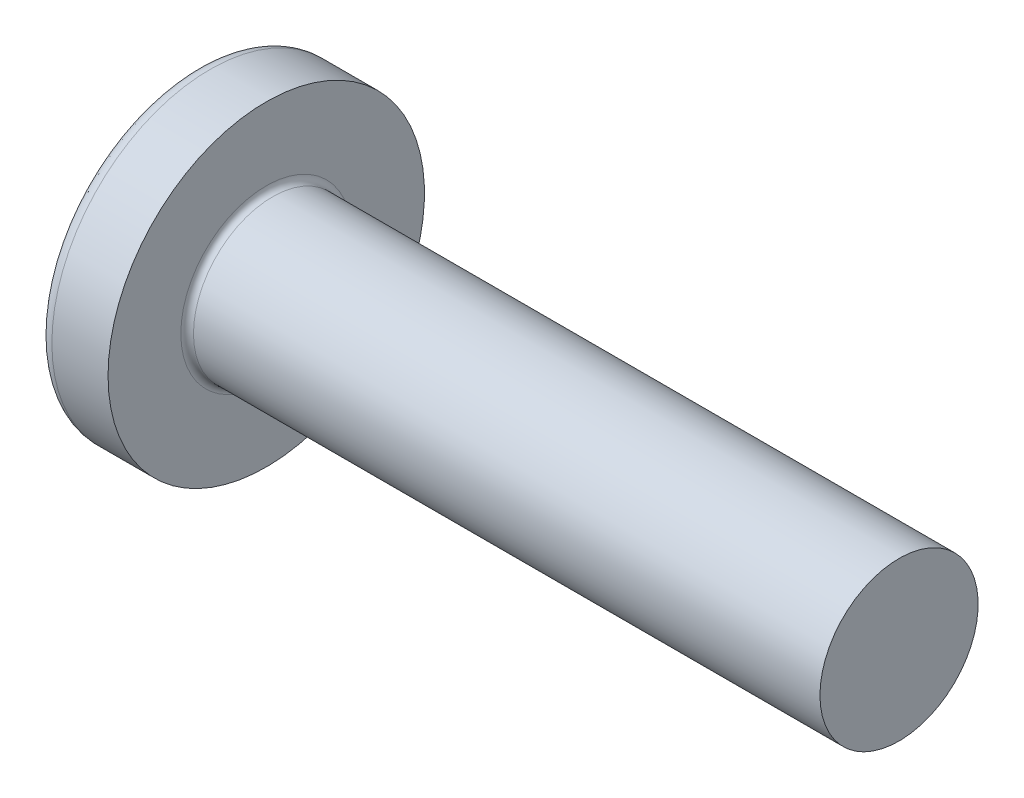
ISO-10303-21;
HEADER;
FILE_DESCRIPTION(('STEP AP214'),'2;1');
FILE_NAME('part.step','',(''),(''),'','','');
FILE_SCHEMA(('AUTOMOTIVE_DESIGN { 1 0 10303 214 1 1 1 1 }'));
ENDSEC;
DATA;
#1=APPLICATION_CONTEXT('core data for automotive mechanical design processes');
#2=APPLICATION_PROTOCOL_DEFINITION('international standard','automotive_design',2000,#1);
#3=PRODUCT_CONTEXT('',#1,'mechanical');
#4=PRODUCT('Part','Part','',(#3));
#5=PRODUCT_RELATED_PRODUCT_CATEGORY('part','',(#4));
#6=PRODUCT_DEFINITION_FORMATION('','',#4);
#7=PRODUCT_DEFINITION_CONTEXT('part definition',#1,'design');
#8=PRODUCT_DEFINITION('design','',#6,#7);
#9=PRODUCT_DEFINITION_SHAPE('','',#8);
#10=(LENGTH_UNIT() NAMED_UNIT(*) SI_UNIT(.MILLI.,.METRE.));
#11=(NAMED_UNIT(*) PLANE_ANGLE_UNIT() SI_UNIT($,.RADIAN.));
#12=(NAMED_UNIT(*) SI_UNIT($,.STERADIAN.) SOLID_ANGLE_UNIT());
#13=UNCERTAINTY_MEASURE_WITH_UNIT(LENGTH_MEASURE(1.E-05),#10,'distance_accuracy_value','');
#14=(GEOMETRIC_REPRESENTATION_CONTEXT(3) GLOBAL_UNCERTAINTY_ASSIGNED_CONTEXT((#13)) GLOBAL_UNIT_ASSIGNED_CONTEXT((#10,
#11,#12)) REPRESENTATION_CONTEXT('',''));
#15=CARTESIAN_POINT('',(0.,0.,0.));
#16=DIRECTION('',(0.,0.,1.));
#17=DIRECTION('',(1.,0.,0.));
#18=AXIS2_PLACEMENT_3D('',#15,#16,#17);
#19=CARTESIAN_POINT('',(16.,0.,0.));
#20=DIRECTION('',(-1.,0.,0.));
#21=DIRECTION('',(0.,1.,0.));
#22=AXIS2_PLACEMENT_3D('',#19,#20,#21);
#23=SPHERICAL_SURFACE('',#22,16.);
#24=CARTESIAN_POINT('',(3.23189799723057,0.,0.));
#25=DIRECTION('',(-1.,0.,0.));
#26=DIRECTION('',(0.,0.,1.));
#27=AXIS2_PLACEMENT_3D('',#24,#25,#26);
#28=CIRCLE('',#27,9.64238410596027);
#29=CARTESIAN_POINT('',(3.23189799723057,0.,9.64238410596027));
#30=VERTEX_POINT('',#29);
#31=EDGE_CURVE('E212',#30,#30,#28,.T.);
#32=ORIENTED_EDGE('',*,*,#31,.T.);
#33=EDGE_LOOP('',(#32));
#34=FACE_BOUND('',#33,.T.);
#35=CARTESIAN_POINT('',(0.168594787067849,0.,0.));
#36=DIRECTION('',(1.,0.,0.));
#37=DIRECTION('',(0.,0.,-1.));
#38=AXIS2_PLACEMENT_3D('',#35,#36,#37);
#39=CIRCLE('',#38,2.31659426398858);
#40=CARTESIAN_POINT('',(0.168594787067853,-1.07999999999999,-2.04944113941943));
#41=VERTEX_POINT('',#40);
#42=CARTESIAN_POINT('',(0.168594787067849,-2.04944113941942,-1.08));
#43=VERTEX_POINT('',#42);
#44=EDGE_CURVE('E338',#41,#43,#39,.F.);
#45=ORIENTED_EDGE('',*,*,#44,.F.);
#46=CARTESIAN_POINT('',(16.,-1.08,0.));
#47=DIRECTION('',(0.,1.,0.));
#48=DIRECTION('',(0.,0.,1.));
#49=AXIS2_PLACEMENT_3D('',#46,#47,#48);
#50=CIRCLE('',#49,15.9635083863166);
#51=CARTESIAN_POINT('',(0.712098414668225,-1.07999999999998,-4.59496083957308));
#52=VERTEX_POINT('',#51);
#53=EDGE_CURVE('E272',#52,#41,#50,.T.);
#54=ORIENTED_EDGE('',*,*,#53,.F.);
#55=CARTESIAN_POINT('',(14.7911432076015,0.,2.42459171093353));
#56=DIRECTION('',(0.446197800778958,0.,-0.89493436774996));
#57=DIRECTION('',(-0.89493436774996,0.,-0.446197800778958));
#58=AXIS2_PLACEMENT_3D('',#55,#56,#57);
#59=CIRCLE('',#58,15.7689574890271);
#60=CARTESIAN_POINT('',(0.712098414668225,1.08000000000002,-4.59496083957307));
#61=VERTEX_POINT('',#60);
#62=EDGE_CURVE('E246',#52,#61,#59,.T.);
#63=ORIENTED_EDGE('',*,*,#62,.T.);
#64=CARTESIAN_POINT('',(16.,1.08,0.));
#65=DIRECTION('',(0.,-1.,0.));
#66=DIRECTION('',(0.,0.,-1.));
#67=AXIS2_PLACEMENT_3D('',#64,#65,#66);
#68=CIRCLE('',#67,15.9635083863166);
#69=CARTESIAN_POINT('',(0.168594787067854,1.08000000000001,-2.04944113941942));
#70=VERTEX_POINT('',#69);
#71=EDGE_CURVE('E300',#70,#61,#68,.T.);
#72=ORIENTED_EDGE('',*,*,#71,.F.);
#73=CARTESIAN_POINT('',(0.168594787067849,2.04944113941941,-1.08));
#74=VERTEX_POINT('',#73);
#75=EDGE_CURVE('E353',#74,#70,#39,.F.);
#76=ORIENTED_EDGE('',*,*,#75,.F.);
#77=CARTESIAN_POINT('',(16.,0.,-1.08));
#78=DIRECTION('',(0.,0.,1.));
#79=DIRECTION('',(1.,0.,0.));
#80=AXIS2_PLACEMENT_3D('',#77,#78,#79);
#81=CIRCLE('',#80,15.9635083863166);
#82=CARTESIAN_POINT('',(0.712098414668223,4.59496083957308,-1.08));
#83=VERTEX_POINT('',#82);
#84=EDGE_CURVE('E240',#83,#74,#81,.T.);
#85=ORIENTED_EDGE('',*,*,#84,.F.);
#86=CARTESIAN_POINT('',(14.7911432076015,-2.42459171093353,0.));
#87=DIRECTION('',(0.446197800778958,0.89493436774996,0.));
#88=DIRECTION('',(-0.89493436774996,0.446197800778958,0.));
#89=AXIS2_PLACEMENT_3D('',#86,#87,#88);
#90=CIRCLE('',#89,15.7689574890271);
#91=CARTESIAN_POINT('',(0.712098414668223,4.59496083957308,1.08));
#92=VERTEX_POINT('',#91);
#93=EDGE_CURVE('E243',#83,#92,#90,.T.);
#94=ORIENTED_EDGE('',*,*,#93,.T.);
#95=CARTESIAN_POINT('',(16.,0.,1.08));
#96=DIRECTION('',(0.,0.,-1.));
#97=DIRECTION('',(0.,1.,0.));
#98=AXIS2_PLACEMENT_3D('',#95,#96,#97);
#99=CIRCLE('',#98,15.9635083863166);
#100=CARTESIAN_POINT('',(0.168594787067849,2.0494411394194,1.08));
#101=VERTEX_POINT('',#100);
#102=EDGE_CURVE('E236',#101,#92,#99,.T.);
#103=ORIENTED_EDGE('',*,*,#102,.F.);
#104=CARTESIAN_POINT('',(0.168594787067853,1.07999999999999,2.04944113941943));
#105=VERTEX_POINT('',#104);
#106=EDGE_CURVE('E352',#105,#101,#39,.F.);
#107=ORIENTED_EDGE('',*,*,#106,.F.);
#108=CARTESIAN_POINT('',(0.712098414668223,1.07999999999998,4.59496083957308));
#109=VERTEX_POINT('',#108);
#110=EDGE_CURVE('E256',#109,#105,#68,.T.);
#111=ORIENTED_EDGE('',*,*,#110,.F.);
#112=CARTESIAN_POINT('',(14.7911432076015,0.,-2.42459171093353));
#113=DIRECTION('',(0.446197800778958,0.,0.89493436774996));
#114=DIRECTION('',(0.89493436774996,0.,-0.446197800778958));
#115=AXIS2_PLACEMENT_3D('',#112,#113,#114);
#116=CIRCLE('',#115,15.7689574890271);
#117=CARTESIAN_POINT('',(0.712098414668221,-1.08000000000001,4.59496083957308));
#118=VERTEX_POINT('',#117);
#119=EDGE_CURVE('E47',#109,#118,#116,.T.);
#120=ORIENTED_EDGE('',*,*,#119,.T.);
#121=CARTESIAN_POINT('',(0.168594787067854,-1.08000000000001,2.04944113941942));
#122=VERTEX_POINT('',#121);
#123=EDGE_CURVE('E253',#122,#118,#50,.T.);
#124=ORIENTED_EDGE('',*,*,#123,.F.);
#125=CARTESIAN_POINT('',(0.168594787067849,-2.04944113941941,1.08));
#126=VERTEX_POINT('',#125);
#127=EDGE_CURVE('E384',#126,#122,#39,.F.);
#128=ORIENTED_EDGE('',*,*,#127,.F.);
#129=CARTESIAN_POINT('',(0.712098414668223,-4.59496083957308,1.08));
#130=VERTEX_POINT('',#129);
#131=EDGE_CURVE('E237',#130,#126,#99,.T.);
#132=ORIENTED_EDGE('',*,*,#131,.F.);
#133=CARTESIAN_POINT('',(14.7911432076015,2.42459171093353,0.));
#134=DIRECTION('',(0.446197800778958,-0.89493436774996,0.));
#135=DIRECTION('',(0.89493436774996,0.446197800778958,0.));
#136=AXIS2_PLACEMENT_3D('',#133,#134,#135);
#137=CIRCLE('',#136,15.7689574890271);
#138=CARTESIAN_POINT('',(0.712098414668223,-4.59496083957308,-1.08));
#139=VERTEX_POINT('',#138);
#140=EDGE_CURVE('E233',#130,#139,#137,.T.);
#141=ORIENTED_EDGE('',*,*,#140,.T.);
#142=EDGE_CURVE('E62',#43,#139,#81,.T.);
#143=ORIENTED_EDGE('',*,*,#142,.F.);
#144=EDGE_LOOP('',(#45,#54,#63,#72,#76,#85,#94,#103,#107,#111,#120,#124,#128,#132,#141,#143));
#145=FACE_BOUND('',#144,.T.);
#146=ADVANCED_FACE('F34',(#34,#145),#23,.T.);
#147=CARTESIAN_POINT('',(0.,4.94999999999999,-1.08));
#148=DIRECTION('',(0.,0.,1.));
#149=DIRECTION('',(1.,0.,0.));
#150=AXIS2_PLACEMENT_3D('',#147,#148,#149);
#151=PLANE('',#150);
#152=ORIENTED_EDGE('',*,*,#84,.T.);
#153=CARTESIAN_POINT('',(-3.43605311056389,2.33057774319368,-1.08));
#154=CARTESIAN_POINT('',(-2.73005788936149,2.27615518507629,-1.08));
#155=CARTESIAN_POINT('',(-2.02408650858328,2.22141913982355,-1.08));
#156=CARTESIAN_POINT('',(-0.612196178896328,2.11110719124856,-1.08));
#157=CARTESIAN_POINT('',(0.0937227687909005,2.05553127230214,-1.08));
#158=CARTESIAN_POINT('',(1.15253879223642,1.97137932907642,-1.08));
#159=CARTESIAN_POINT('',(1.50546717443927,1.94319732850324,-1.08));
#160=CARTESIAN_POINT('',(2.21129884226403,1.88653195912772,-1.08));
#161=CARTESIAN_POINT('',(2.56420212794819,1.85804859110097,-1.08));
#162=CARTESIAN_POINT('',(3.26997437360886,1.80073759682966,-1.08));
#163=CARTESIAN_POINT('',(3.62284333408858,1.77190997678611,-1.08));
#164=CARTESIAN_POINT('',(4.32855163516413,1.71385567830055,-1.08));
#165=CARTESIAN_POINT('',(4.68139097546501,1.68462899627166,-1.08));
#166=CARTESIAN_POINT('',(5.48196138691584,1.61778484426536,-1.08));
#167=CARTESIAN_POINT('',(5.92968063936628,1.5800255789917,-1.08));
#168=CARTESIAN_POINT('',(6.82503914618352,1.50358396776163,-1.08));
#169=CARTESIAN_POINT('',(7.27267840078263,1.46490162453115,-1.08));
#170=CARTESIAN_POINT('',(8.16783657307055,1.38637288862663,-1.08));
#171=CARTESIAN_POINT('',(8.61535549493061,1.34652654360286,-1.08));
#172=CARTESIAN_POINT('',(9.51026248486919,1.26532289179753,-1.08));
#173=CARTESIAN_POINT('',(9.95765055123334,1.22396556604181,-1.08));
#174=CARTESIAN_POINT('',(10.8523158736642,1.13920912306466,-1.08));
#175=CARTESIAN_POINT('',(11.2995930947875,1.09580963592832,-1.08));
#176=CARTESIAN_POINT('',(12.1938496891445,1.00615798148881,-1.08));
#177=CARTESIAN_POINT('',(12.6408290721386,0.959905912835485,-1.08));
#178=CARTESIAN_POINT('',(13.3109832262361,0.887238538031377,-1.08));
#179=CARTESIAN_POINT('',(13.5343356366705,0.862465479305157,-1.08));
#180=CARTESIAN_POINT('',(13.9808744583761,0.811493247434636,-1.08));
#181=CARTESIAN_POINT('',(14.204060872408,0.785294098569612,-1.08));
#182=CARTESIAN_POINT('',(14.6502320441495,0.73099572543514,-1.08));
#183=CARTESIAN_POINT('',(14.8732167746121,0.702896274763054,-1.08));
#184=CARTESIAN_POINT('',(15.2074339176581,0.658726299947166,-1.08));
#185=CARTESIAN_POINT('',(15.3187994773757,0.643665717094798,-1.08));
#186=CARTESIAN_POINT('',(15.5414149899271,0.612700054932443,-1.08));
#187=CARTESIAN_POINT('',(15.6526649406011,0.596794960123566,-1.08));
#188=CARTESIAN_POINT('',(15.7638416271016,0.580382331183072,-1.08));
#189=B_SPLINE_CURVE_WITH_KNOTS('',3,(#153,#154,#155,#156,#157,#158,#159,#160,#161,#162,#163,
#164,#165,#166,#167,#168,#169,#170,#171,#172,#173,#174,#175,#176,#177,#178,#179,#180,#181,#182,
#183,#184,#185,#186,#187,#188),.UNSPECIFIED.,.F.,.F.,(4,2,2,2,2,2,2,2,2,2,2,2,2,2,2,2,2,4),(0.,
2.12426964290659,4.24857885235091,5.3107341035929,6.37288662197896,7.43502003656715,
8.49716300414631,9.84508827634153,11.1930095684778,12.5408757584157,13.8887588800163,
15.2368871027213,16.5849687296847,17.2591314568035,17.9332827098455,18.6075144234906,
18.9446495011757,19.2817907682658),.UNSPECIFIED.);
#190=CARTESIAN_POINT('',(5.69,1.60013444747621,-1.08));
#191=VERTEX_POINT('',#190);
#192=EDGE_CURVE('E373',#74,#191,#189,.T.);
#193=ORIENTED_EDGE('',*,*,#192,.T.);
#194=DIRECTION('',(0.,1.,0.));
#195=VECTOR('',#194,1.);
#196=CARTESIAN_POINT('',(5.69,-2.11307074806449,-1.08));
#197=LINE('',#196,#195);
#198=CARTESIAN_POINT('',(5.69,2.11307074806449,-1.08));
#199=VERTEX_POINT('',#198);
#200=EDGE_CURVE('E321',#191,#199,#197,.T.);
#201=ORIENTED_EDGE('',*,*,#200,.T.);
#202=DIRECTION('',(0.89493436774996,-0.446197800778958,0.));
#203=VECTOR('',#202,1.);
#204=CARTESIAN_POINT('',(0.,4.95,-1.08));
#205=LINE('',#204,#203);
#206=EDGE_CURVE('E213',#83,#199,#205,.T.);
#207=ORIENTED_EDGE('',*,*,#206,.F.);
#208=EDGE_LOOP('',(#152,#193,#201,#207));
#209=FACE_BOUND('',#208,.T.);
#210=ADVANCED_FACE('F168',(#209),#151,.T.);
#211=CARTESIAN_POINT('',(5.69,-2.11307074806449,-1.08));
#212=VERTEX_POINT('',#211);
#213=CARTESIAN_POINT('',(5.69,-1.60013444747621,-1.08));
#214=VERTEX_POINT('',#213);
#215=EDGE_CURVE('E221',#212,#214,#197,.T.);
#216=ORIENTED_EDGE('',*,*,#215,.T.);
#217=CARTESIAN_POINT('',(-3.43605311056389,-2.33057774319368,-1.08));
#218=CARTESIAN_POINT('',(-2.73005788936149,-2.27615518507629,-1.08));
#219=CARTESIAN_POINT('',(-2.02408650858328,-2.22141913982355,-1.08));
#220=CARTESIAN_POINT('',(-0.612196178896328,-2.11110719124856,-1.08));
#221=CARTESIAN_POINT('',(0.0937227687909004,-2.05553127230214,-1.08));
#222=CARTESIAN_POINT('',(1.15253879223642,-1.97137932907642,-1.08));
#223=CARTESIAN_POINT('',(1.50546717443927,-1.94319732850324,-1.08));
#224=CARTESIAN_POINT('',(2.21129884226403,-1.88653195912772,-1.08));
#225=CARTESIAN_POINT('',(2.56420212794819,-1.85804859110097,-1.08));
#226=CARTESIAN_POINT('',(3.26997437360886,-1.80073759682966,-1.08));
#227=CARTESIAN_POINT('',(3.62284333408858,-1.77190997678611,-1.08));
#228=CARTESIAN_POINT('',(4.32855163516414,-1.71385567830055,-1.08));
#229=CARTESIAN_POINT('',(4.68139097546501,-1.68462899627166,-1.08));
#230=CARTESIAN_POINT('',(5.48196138691584,-1.61778484426536,-1.08));
#231=CARTESIAN_POINT('',(5.92968063936628,-1.5800255789917,-1.08));
#232=CARTESIAN_POINT('',(6.82503914618352,-1.50358396776163,-1.08));
#233=CARTESIAN_POINT('',(7.27267840078262,-1.46490162453115,-1.08));
#234=CARTESIAN_POINT('',(8.16783657307055,-1.38637288862663,-1.08));
#235=CARTESIAN_POINT('',(8.6153554949306,-1.34652654360286,-1.08));
#236=CARTESIAN_POINT('',(9.51026248486919,-1.26532289179753,-1.08));
#237=CARTESIAN_POINT('',(9.95765055123334,-1.22396556604181,-1.08));
#238=CARTESIAN_POINT('',(10.8523158736642,-1.13920912306466,-1.08));
#239=CARTESIAN_POINT('',(11.2995930947875,-1.09580963592832,-1.08));
#240=CARTESIAN_POINT('',(12.1938496891445,-1.00615798148881,-1.08));
#241=CARTESIAN_POINT('',(12.6408290721386,-0.959905912835485,-1.08));
#242=CARTESIAN_POINT('',(13.3109832262361,-0.887238538031377,-1.08));
#243=CARTESIAN_POINT('',(13.5343356366705,-0.862465479305157,-1.08));
#244=CARTESIAN_POINT('',(13.9808744583761,-0.811493247434636,-1.08));
#245=CARTESIAN_POINT('',(14.204060872408,-0.785294098569612,-1.08));
#246=CARTESIAN_POINT('',(14.6502320441495,-0.730995725435139,-1.08));
#247=CARTESIAN_POINT('',(14.8732167746121,-0.702896274763054,-1.08));
#248=CARTESIAN_POINT('',(15.2074339176582,-0.658726299947166,-1.08));
#249=CARTESIAN_POINT('',(15.3187994773757,-0.643665717094798,-1.08));
#250=CARTESIAN_POINT('',(15.5414149899271,-0.612700054932442,-1.08));
#251=CARTESIAN_POINT('',(15.6526649406011,-0.596794960123565,-1.08));
#252=CARTESIAN_POINT('',(15.7638416271017,-0.580382331183071,-1.08));
#253=B_SPLINE_CURVE_WITH_KNOTS('',3,(#217,#218,#219,#220,#221,#222,#223,#224,#225,#226,#227,
#228,#229,#230,#231,#232,#233,#234,#235,#236,#237,#238,#239,#240,#241,#242,#243,#244,#245,#246,
#247,#248,#249,#250,#251,#252),.UNSPECIFIED.,.F.,.F.,(4,2,2,2,2,2,2,2,2,2,2,2,2,2,2,2,2,4),(0.,
2.12426964290659,4.24857885235091,5.3107341035929,6.37288662197896,7.43502003656715,
8.49716300414631,9.84508827634153,11.1930095684778,12.5408757584157,13.8887588800163,
15.2368871027213,16.5849687296847,17.2591314568035,17.9332827098455,18.6075144234906,
18.9446495011757,19.2817907682658),.UNSPECIFIED.);
#254=EDGE_CURVE('E351',#214,#43,#253,.F.);
#255=ORIENTED_EDGE('',*,*,#254,.T.);
#256=ORIENTED_EDGE('',*,*,#142,.T.);
#257=DIRECTION('',(0.89493436774996,0.446197800778958,0.));
#258=VECTOR('',#257,1.);
#259=CARTESIAN_POINT('',(0.,-4.95,-1.08));
#260=LINE('',#259,#258);
#261=EDGE_CURVE('E303',#139,#212,#260,.T.);
#262=ORIENTED_EDGE('',*,*,#261,.T.);
#263=EDGE_LOOP('',(#216,#255,#256,#262));
#264=FACE_BOUND('',#263,.T.);
#265=ADVANCED_FACE('F174',(#264),#151,.T.);
#266=CARTESIAN_POINT('',(0.,-4.94999999999999,1.08));
#267=DIRECTION('',(0.,0.,-1.));
#268=DIRECTION('',(0.,1.,0.));
#269=AXIS2_PLACEMENT_3D('',#266,#267,#268);
#270=PLANE('',#269);
#271=DIRECTION('',(0.,-1.,0.));
#272=VECTOR('',#271,1.);
#273=CARTESIAN_POINT('',(5.69,2.11307074806449,1.08));
#274=LINE('',#273,#272);
#275=CARTESIAN_POINT('',(5.69,2.11307074806449,1.08));
#276=VERTEX_POINT('',#275);
#277=CARTESIAN_POINT('',(5.69,1.60013444747621,1.08));
#278=VERTEX_POINT('',#277);
#279=EDGE_CURVE('E311',#276,#278,#274,.T.);
#280=ORIENTED_EDGE('',*,*,#279,.T.);
#281=CARTESIAN_POINT('',(-3.43605312354531,2.33057774419416,1.08));
#282=CARTESIAN_POINT('',(-2.73005790068362,2.27615518595292,1.08));
#283=CARTESIAN_POINT('',(-2.02408651824618,2.22141914057536,1.08));
#284=CARTESIAN_POINT('',(-0.612196185240834,2.11110719174749,1.08));
#285=CARTESIAN_POINT('',(0.0937227641055548,2.055531272673,1.08));
#286=CARTESIAN_POINT('',(1.15253879056997,1.97137932920962,1.08));
#287=CARTESIAN_POINT('',(1.50546717413264,1.94319732852816,1.08));
#288=CARTESIAN_POINT('',(2.21129884467686,1.88653195893371,1.08));
#289=CARTESIAN_POINT('',(2.56420213172064,1.85804859079632,1.08));
#290=CARTESIAN_POINT('',(3.26997438010022,1.80073759630085,1.08));
#291=CARTESIAN_POINT('',(3.62284334193923,1.77190997614379,1.08));
#292=CARTESIAN_POINT('',(4.32855164573311,1.7138556774276,1.08));
#293=CARTESIAN_POINT('',(4.68139098739302,1.68462899528161,1.08));
#294=CARTESIAN_POINT('',(5.48196140020257,1.61778484314849,1.08));
#295=CARTESIAN_POINT('',(5.92968065265283,1.58002557786661,1.08));
#296=CARTESIAN_POINT('',(6.82503915946948,1.50358396661807,1.08));
#297=CARTESIAN_POINT('',(7.27267841406819,1.46490162337736,1.08));
#298=CARTESIAN_POINT('',(8.16783658635485,1.38637288744954,1.08));
#299=CARTESIAN_POINT('',(8.61535550821404,1.34652654241272,1.08));
#300=CARTESIAN_POINT('',(9.51026249815054,1.26532289057715,1.08));
#301=CARTESIAN_POINT('',(9.95765056451348,1.22396556480425,1.08));
#302=CARTESIAN_POINT('',(10.8523158869419,1.13920912178625,1.08));
#303=CARTESIAN_POINT('',(11.299593108064,1.09580963462624,1.08));
#304=CARTESIAN_POINT('',(12.1938497024173,1.0061579801289,1.08));
#305=CARTESIAN_POINT('',(12.6408290854088,0.959905911441419,1.08));
#306=CARTESIAN_POINT('',(13.3109832395008,0.887238536570858,1.08));
#307=CARTESIAN_POINT('',(13.5343356499334,0.862465477819925,1.08));
#308=CARTESIAN_POINT('',(13.9808744716342,0.811493245892374,1.08));
#309=CARTESIAN_POINT('',(14.2040608856631,0.785294096995034,1.08));
#310=CARTESIAN_POINT('',(14.6502320573974,0.730995723784126,1.08));
#311=CARTESIAN_POINT('',(14.8732167878556,0.702896273067916,1.08));
#312=CARTESIAN_POINT('',(15.2074339308928,0.658726298170583,1.08));
#313=CARTESIAN_POINT('',(15.318799490607,0.643665715288516,1.08));
#314=CARTESIAN_POINT('',(15.5414150031506,0.612700053059414,1.08));
#315=CARTESIAN_POINT('',(15.65266495382,0.596794958213489,1.08));
#316=CARTESIAN_POINT('',(15.7638416403152,0.580382329231146,1.08));
#317=B_SPLINE_CURVE_WITH_KNOTS('',3,(#281,#282,#283,#284,#285,#286,#287,#288,#289,#290,#291,
#292,#293,#294,#295,#296,#297,#298,#299,#300,#301,#302,#303,#304,#305,#306,#307,#308,#309,#310,
#311,#312,#313,#314,#315,#316),.UNSPECIFIED.,.F.,.F.,(4,2,2,2,2,2,2,2,2,2,2,2,2,2,2,2,2,4),(0.,
2.12426964789832,4.24857886233492,5.3107341176693,6.37288664014772,7.43502005882796,
8.49716303049931,9.84508830269604,11.1930095948338,12.5408757847726,13.8887589063742,
15.2368871290825,16.5849687560486,17.25913148317,17.9332827362145,18.607514449863,
18.9446495275502,19.2817907946425),.UNSPECIFIED.);
#318=EDGE_CURVE('E277',#278,#101,#317,.F.);
#319=ORIENTED_EDGE('',*,*,#318,.T.);
#320=ORIENTED_EDGE('',*,*,#102,.T.);
#321=DIRECTION('',(0.89493436774996,-0.446197800778958,0.));
#322=VECTOR('',#321,1.);
#323=CARTESIAN_POINT('',(0.,4.95,1.08));
#324=LINE('',#323,#322);
#325=EDGE_CURVE('E218',#92,#276,#324,.T.);
#326=ORIENTED_EDGE('',*,*,#325,.T.);
#327=EDGE_LOOP('',(#280,#319,#320,#326));
#328=FACE_BOUND('',#327,.T.);
#329=ADVANCED_FACE('F369',(#328),#270,.T.);
#330=ORIENTED_EDGE('',*,*,#131,.T.);
#331=CARTESIAN_POINT('',(-3.43605312354531,-2.33057774419416,1.08));
#332=CARTESIAN_POINT('',(-2.73005790068362,-2.27615518595292,1.08));
#333=CARTESIAN_POINT('',(-2.02408651824618,-2.22141914057536,1.08));
#334=CARTESIAN_POINT('',(-0.612196185240833,-2.11110719174749,1.08));
#335=CARTESIAN_POINT('',(0.0937227641055558,-2.055531272673,1.08));
#336=CARTESIAN_POINT('',(1.15253879056997,-1.97137932920962,1.08));
#337=CARTESIAN_POINT('',(1.50546717413264,-1.94319732852816,1.08));
#338=CARTESIAN_POINT('',(2.21129884467686,-1.88653195893371,1.08));
#339=CARTESIAN_POINT('',(2.56420213172064,-1.85804859079632,1.08));
#340=CARTESIAN_POINT('',(3.26997438010022,-1.80073759630085,1.08));
#341=CARTESIAN_POINT('',(3.62284334193923,-1.77190997614379,1.08));
#342=CARTESIAN_POINT('',(4.32855164573311,-1.7138556774276,1.08));
#343=CARTESIAN_POINT('',(4.68139098739302,-1.68462899528161,1.08));
#344=CARTESIAN_POINT('',(5.48196140020257,-1.61778484314849,1.08));
#345=CARTESIAN_POINT('',(5.92968065265283,-1.58002557786661,1.08));
#346=CARTESIAN_POINT('',(6.82503915946948,-1.50358396661807,1.08));
#347=CARTESIAN_POINT('',(7.27267841406819,-1.46490162337736,1.08));
#348=CARTESIAN_POINT('',(8.16783658635484,-1.38637288744954,1.08));
#349=CARTESIAN_POINT('',(8.61535550821403,-1.34652654241272,1.08));
#350=CARTESIAN_POINT('',(9.51026249815054,-1.26532289057715,1.08));
#351=CARTESIAN_POINT('',(9.95765056451347,-1.22396556480425,1.08));
#352=CARTESIAN_POINT('',(10.8523158869419,-1.13920912178625,1.08));
#353=CARTESIAN_POINT('',(11.299593108064,-1.09580963462624,1.08));
#354=CARTESIAN_POINT('',(12.1938497024173,-1.0061579801289,1.08));
#355=CARTESIAN_POINT('',(12.6408290854088,-0.959905911441419,1.08));
#356=CARTESIAN_POINT('',(13.3109832395008,-0.88723853657086,1.08));
#357=CARTESIAN_POINT('',(13.5343356499333,-0.862465477819927,1.08));
#358=CARTESIAN_POINT('',(13.9808744716342,-0.811493245892375,1.08));
#359=CARTESIAN_POINT('',(14.2040608856631,-0.785294096995036,1.08));
#360=CARTESIAN_POINT('',(14.6502320573974,-0.730995723784127,1.08));
#361=CARTESIAN_POINT('',(14.8732167878556,-0.702896273067917,1.08));
#362=CARTESIAN_POINT('',(15.2074339308928,-0.658726298170585,1.08));
#363=CARTESIAN_POINT('',(15.318799490607,-0.643665715288517,1.08));
#364=CARTESIAN_POINT('',(15.5414150031506,-0.612700053059415,1.08));
#365=CARTESIAN_POINT('',(15.65266495382,-0.59679495821349,1.08));
#366=CARTESIAN_POINT('',(15.7638416403152,-0.580382329231147,1.08));
#367=B_SPLINE_CURVE_WITH_KNOTS('',3,(#331,#332,#333,#334,#335,#336,#337,#338,#339,#340,#341,
#342,#343,#344,#345,#346,#347,#348,#349,#350,#351,#352,#353,#354,#355,#356,#357,#358,#359,#360,
#361,#362,#363,#364,#365,#366),.UNSPECIFIED.,.F.,.F.,(4,2,2,2,2,2,2,2,2,2,2,2,2,2,2,2,2,4),(0.,
2.12426964789832,4.24857886233492,5.3107341176693,6.37288664014772,7.43502005882796,
8.49716303049931,9.84508830269603,11.1930095948338,12.5408757847726,13.8887589063742,
15.2368871290825,16.5849687560486,17.25913148317,17.9332827362145,18.607514449863,
18.9446495275502,19.2817907946425),.UNSPECIFIED.);
#368=CARTESIAN_POINT('',(5.69,-1.60013444747621,1.08));
#369=VERTEX_POINT('',#368);
#370=EDGE_CURVE('E385',#126,#369,#367,.T.);
#371=ORIENTED_EDGE('',*,*,#370,.T.);
#372=CARTESIAN_POINT('',(5.69,-2.11307074806449,1.08));
#373=VERTEX_POINT('',#372);
#374=EDGE_CURVE('E313',#369,#373,#274,.T.);
#375=ORIENTED_EDGE('',*,*,#374,.T.);
#376=DIRECTION('',(0.89493436774996,0.446197800778958,0.));
#377=VECTOR('',#376,1.);
#378=CARTESIAN_POINT('',(0.,-4.95,1.08));
#379=LINE('',#378,#377);
#380=EDGE_CURVE('E305',#130,#373,#379,.T.);
#381=ORIENTED_EDGE('',*,*,#380,.F.);
#382=EDGE_LOOP('',(#330,#371,#375,#381));
#383=FACE_BOUND('',#382,.T.);
#384=ADVANCED_FACE('F412',(#383),#270,.T.);
#385=CARTESIAN_POINT('',(5.69,2.11307074806449,-1.08));
#386=DIRECTION('',(-1.,0.,0.));
#387=DIRECTION('',(0.,0.,1.));
#388=AXIS2_PLACEMENT_3D('',#385,#386,#387);
#389=PLANE('',#388);
#390=ORIENTED_EDGE('',*,*,#374,.F.);
#391=CARTESIAN_POINT('',(5.69,0.,0.));
#392=DIRECTION('',(-1.,0.,0.));
#393=DIRECTION('',(0.,0.,1.));
#394=AXIS2_PLACEMENT_3D('',#391,#392,#393);
#395=CIRCLE('',#394,1.9305);
#396=EDGE_CURVE('E346',#214,#369,#395,.T.);
#397=ORIENTED_EDGE('',*,*,#396,.F.);
#398=ORIENTED_EDGE('',*,*,#215,.F.);
#399=DIRECTION('',(0.,0.,1.));
#400=VECTOR('',#399,1.);
#401=CARTESIAN_POINT('',(5.69,-2.11307074806449,-1.08));
#402=LINE('',#401,#400);
#403=EDGE_CURVE('E308',#212,#373,#402,.T.);
#404=ORIENTED_EDGE('',*,*,#403,.T.);
#405=EDGE_LOOP('',(#390,#397,#398,#404));
#406=FACE_BOUND('',#405,.T.);
#407=ADVANCED_FACE('F410',(#406),#389,.T.);
#408=DIRECTION('',(0.,0.,-1.));
#409=VECTOR('',#408,1.);
#410=CARTESIAN_POINT('',(5.69,-1.08000000000001,2.11307074806449));
#411=LINE('',#410,#409);
#412=CARTESIAN_POINT('',(5.69,-1.07999999999999,-1.60013444747621));
#413=VERTEX_POINT('',#412);
#414=CARTESIAN_POINT('',(5.69,-1.07999999999999,-2.1130707480645));
#415=VERTEX_POINT('',#414);
#416=EDGE_CURVE('E294',#413,#415,#411,.T.);
#417=ORIENTED_EDGE('',*,*,#416,.F.);
#418=CARTESIAN_POINT('',(5.69,1.08000000000001,-1.60013444747621));
#419=VERTEX_POINT('',#418);
#420=EDGE_CURVE('E54',#419,#413,#395,.T.);
#421=ORIENTED_EDGE('',*,*,#420,.F.);
#422=DIRECTION('',(0.,0.,1.));
#423=VECTOR('',#422,1.);
#424=CARTESIAN_POINT('',(5.69,1.08000000000001,-2.11307074806449));
#425=LINE('',#424,#423);
#426=CARTESIAN_POINT('',(5.69,1.08000000000001,-2.11307074806449));
#427=VERTEX_POINT('',#426);
#428=EDGE_CURVE('E297',#427,#419,#425,.T.);
#429=ORIENTED_EDGE('',*,*,#428,.F.);
#430=DIRECTION('',(0.,-1.,0.));
#431=VECTOR('',#430,1.);
#432=CARTESIAN_POINT('',(5.69,1.08000000000001,-2.11307074806449));
#433=LINE('',#432,#431);
#434=EDGE_CURVE('E288',#427,#415,#433,.T.);
#435=ORIENTED_EDGE('',*,*,#434,.T.);
#436=EDGE_LOOP('',(#417,#421,#429,#435));
#437=FACE_BOUND('',#436,.T.);
#438=ADVANCED_FACE('F341',(#437),#389,.T.);
#439=ORIENTED_EDGE('',*,*,#200,.F.);
#440=EDGE_CURVE('E345',#278,#191,#395,.T.);
#441=ORIENTED_EDGE('',*,*,#440,.F.);
#442=ORIENTED_EDGE('',*,*,#279,.F.);
#443=DIRECTION('',(0.,0.,-1.));
#444=VECTOR('',#443,1.);
#445=CARTESIAN_POINT('',(5.69,2.11307074806449,1.08));
#446=LINE('',#445,#444);
#447=EDGE_CURVE('E314',#276,#199,#446,.T.);
#448=ORIENTED_EDGE('',*,*,#447,.T.);
#449=EDGE_LOOP('',(#439,#441,#442,#448));
#450=FACE_BOUND('',#449,.T.);
#451=ADVANCED_FACE('F419',(#450),#389,.T.);
#452=CARTESIAN_POINT('',(5.69,1.07999999999999,1.60013444747621));
#453=VERTEX_POINT('',#452);
#454=CARTESIAN_POINT('',(5.69,1.07999999999999,2.1130707480645));
#455=VERTEX_POINT('',#454);
#456=EDGE_CURVE('E270',#453,#455,#425,.T.);
#457=ORIENTED_EDGE('',*,*,#456,.F.);
#458=CARTESIAN_POINT('',(5.69,-1.08000000000001,1.60013444747621));
#459=VERTEX_POINT('',#458);
#460=EDGE_CURVE('E349',#459,#453,#395,.T.);
#461=ORIENTED_EDGE('',*,*,#460,.F.);
#462=CARTESIAN_POINT('',(5.69,-1.08000000000001,2.11307074806449));
#463=VERTEX_POINT('',#462);
#464=EDGE_CURVE('E291',#463,#459,#411,.T.);
#465=ORIENTED_EDGE('',*,*,#464,.F.);
#466=DIRECTION('',(0.,1.,0.));
#467=VECTOR('',#466,1.);
#468=CARTESIAN_POINT('',(5.69,-1.08000000000001,2.11307074806449));
#469=LINE('',#468,#467);
#470=EDGE_CURVE('E295',#463,#455,#469,.T.);
#471=ORIENTED_EDGE('',*,*,#470,.T.);
#472=EDGE_LOOP('',(#457,#461,#465,#471));
#473=FACE_BOUND('',#472,.T.);
#474=ADVANCED_FACE('F414',(#473),#389,.T.);
#475=CARTESIAN_POINT('',(0.,1.07999999999998,4.95));
#476=DIRECTION('',(0.,-1.,0.));
#477=DIRECTION('',(1.,0.,0.));
#478=AXIS2_PLACEMENT_3D('',#475,#476,#477);
#479=PLANE('',#478);
#480=ORIENTED_EDGE('',*,*,#110,.T.);
#481=CARTESIAN_POINT('',(-3.43605312354531,1.07999999999999,2.33057774419416));
#482=CARTESIAN_POINT('',(-2.73005790068362,1.07999999999999,2.27615518595292));
#483=CARTESIAN_POINT('',(-2.02408651824618,1.07999999999999,2.22141914057537));
#484=CARTESIAN_POINT('',(-0.612196185240833,1.07999999999999,2.11110719174749));
#485=CARTESIAN_POINT('',(0.0937227641055562,1.07999999999999,2.05553127267301));
#486=CARTESIAN_POINT('',(1.15253879056997,1.07999999999999,1.97137932920963));
#487=CARTESIAN_POINT('',(1.50546717413264,1.07999999999999,1.94319732852816));
#488=CARTESIAN_POINT('',(2.21129884467686,1.07999999999999,1.88653195893372));
#489=CARTESIAN_POINT('',(2.56420213172064,1.07999999999999,1.85804859079632));
#490=CARTESIAN_POINT('',(3.26997438010022,1.07999999999999,1.80073759630085));
#491=CARTESIAN_POINT('',(3.62284334193923,1.07999999999999,1.77190997614379));
#492=CARTESIAN_POINT('',(4.32855164573311,1.07999999999999,1.71385567742761));
#493=CARTESIAN_POINT('',(4.68139098739302,1.07999999999999,1.68462899528162));
#494=CARTESIAN_POINT('',(5.48196140020257,1.07999999999999,1.61778484314849));
#495=CARTESIAN_POINT('',(5.92968065265283,1.07999999999999,1.58002557786661));
#496=CARTESIAN_POINT('',(6.82503915946948,1.07999999999999,1.50358396661808));
#497=CARTESIAN_POINT('',(7.27267841406819,1.07999999999999,1.46490162337736));
#498=CARTESIAN_POINT('',(8.16783658635484,1.08,1.38637288744955));
#499=CARTESIAN_POINT('',(8.61535550821403,1.08,1.34652654241272));
#500=CARTESIAN_POINT('',(9.51026249815054,1.08,1.26532289057715));
#501=CARTESIAN_POINT('',(9.95765056451347,1.08,1.22396556480425));
#502=CARTESIAN_POINT('',(10.8523158869419,1.08,1.13920912178626));
#503=CARTESIAN_POINT('',(11.299593108064,1.08,1.09580963462625));
#504=CARTESIAN_POINT('',(12.1938497024173,1.08,1.00615798012891));
#505=CARTESIAN_POINT('',(12.6408290854088,1.08,0.959905911441422));
#506=CARTESIAN_POINT('',(13.3109832395008,1.08,0.887238536570863));
#507=CARTESIAN_POINT('',(13.5343356499333,1.08,0.86246547781993));
#508=CARTESIAN_POINT('',(13.9808744716342,1.08,0.811493245892379));
#509=CARTESIAN_POINT('',(14.2040608856631,1.08,0.785294096995039));
#510=CARTESIAN_POINT('',(14.6502320573974,1.08,0.73099572378413));
#511=CARTESIAN_POINT('',(14.8732167878556,1.08,0.70289627306792));
#512=CARTESIAN_POINT('',(15.2074339308928,1.08,0.658726298170588));
#513=CARTESIAN_POINT('',(15.318799490607,1.08,0.64366571528852));
#514=CARTESIAN_POINT('',(15.5414150031506,1.08,0.612700053059417));
#515=CARTESIAN_POINT('',(15.65266495382,1.08,0.596794958213493));
#516=CARTESIAN_POINT('',(15.7638416403152,1.08,0.58038232923115));
#517=B_SPLINE_CURVE_WITH_KNOTS('',3,(#481,#482,#483,#484,#485,#486,#487,#488,#489,#490,#491,
#492,#493,#494,#495,#496,#497,#498,#499,#500,#501,#502,#503,#504,#505,#506,#507,#508,#509,#510,
#511,#512,#513,#514,#515,#516),.UNSPECIFIED.,.F.,.F.,(4,2,2,2,2,2,2,2,2,2,2,2,2,2,2,2,2,4),(0.,
2.12426964789832,4.24857886233492,5.3107341176693,6.37288664014772,7.43502005882796,
8.49716303049931,9.84508830269604,11.1930095948338,12.5408757847726,13.8887589063742,
15.2368871290825,16.5849687560486,17.25913148317,17.9332827362145,18.607514449863,
18.9446495275502,19.2817907946425),.UNSPECIFIED.);
#518=EDGE_CURVE('E433',#105,#453,#517,.T.);
#519=ORIENTED_EDGE('',*,*,#518,.T.);
#520=ORIENTED_EDGE('',*,*,#456,.T.);
#521=DIRECTION('',(0.89493436774996,0.,-0.446197800778958));
#522=VECTOR('',#521,1.);
#523=CARTESIAN_POINT('',(0.,1.07999999999998,4.95));
#524=LINE('',#523,#522);
#525=EDGE_CURVE('E263',#109,#455,#524,.T.);
#526=ORIENTED_EDGE('',*,*,#525,.F.);
#527=EDGE_LOOP('',(#480,#519,#520,#526));
#528=FACE_BOUND('',#527,.T.);
#529=ADVANCED_FACE('F267',(#528),#479,.T.);
#530=CARTESIAN_POINT('',(0.,-1.07999999999998,-4.95));
#531=DIRECTION('',(0.,1.,0.));
#532=DIRECTION('',(0.,0.,1.));
#533=AXIS2_PLACEMENT_3D('',#530,#531,#532);
#534=PLANE('',#533);
#535=ORIENTED_EDGE('',*,*,#464,.T.);
#536=CARTESIAN_POINT('',(-3.43605312354531,-1.08000000000001,2.33057774419416));
#537=CARTESIAN_POINT('',(-2.73005790068362,-1.08000000000001,2.27615518595292));
#538=CARTESIAN_POINT('',(-2.02408651824618,-1.08000000000001,2.22141914057536));
#539=CARTESIAN_POINT('',(-0.612196185240836,-1.08000000000001,2.11110719174748));
#540=CARTESIAN_POINT('',(0.0937227641055548,-1.08000000000001,2.055531272673));
#541=CARTESIAN_POINT('',(1.15253879056997,-1.08000000000001,1.97137932920962));
#542=CARTESIAN_POINT('',(1.50546717413264,-1.08000000000001,1.94319732852816));
#543=CARTESIAN_POINT('',(2.21129884467686,-1.08000000000001,1.88653195893371));
#544=CARTESIAN_POINT('',(2.56420213172064,-1.08000000000001,1.85804859079632));
#545=CARTESIAN_POINT('',(3.26997438010022,-1.08000000000001,1.80073759630085));
#546=CARTESIAN_POINT('',(3.62284334193923,-1.08000000000001,1.77190997614378));
#547=CARTESIAN_POINT('',(4.32855164573311,-1.08000000000001,1.7138556774276));
#548=CARTESIAN_POINT('',(4.68139098739302,-1.08000000000001,1.68462899528161));
#549=CARTESIAN_POINT('',(5.48196140020257,-1.08000000000001,1.61778484314848));
#550=CARTESIAN_POINT('',(5.92968065265283,-1.08000000000001,1.5800255778666));
#551=CARTESIAN_POINT('',(6.82503915946948,-1.08000000000001,1.50358396661807));
#552=CARTESIAN_POINT('',(7.27267841406818,-1.08,1.46490162337735));
#553=CARTESIAN_POINT('',(8.16783658635484,-1.08,1.38637288744954));
#554=CARTESIAN_POINT('',(8.61535550821403,-1.08,1.34652654241272));
#555=CARTESIAN_POINT('',(9.51026249815053,-1.08,1.26532289057715));
#556=CARTESIAN_POINT('',(9.95765056451346,-1.08,1.22396556480424));
#557=CARTESIAN_POINT('',(10.8523158869419,-1.08,1.13920912178625));
#558=CARTESIAN_POINT('',(11.299593108064,-1.08,1.09580963462624));
#559=CARTESIAN_POINT('',(12.1938497024173,-1.08,1.0061579801289));
#560=CARTESIAN_POINT('',(12.6408290854088,-1.08,0.959905911441416));
#561=CARTESIAN_POINT('',(13.3109832395008,-1.08,0.887238536570856));
#562=CARTESIAN_POINT('',(13.5343356499333,-1.08,0.862465477819923));
#563=CARTESIAN_POINT('',(13.9808744716342,-1.08,0.811493245892372));
#564=CARTESIAN_POINT('',(14.2040608856631,-1.08,0.785294096995032));
#565=CARTESIAN_POINT('',(14.6502320573974,-1.08,0.730995723784123));
#566=CARTESIAN_POINT('',(14.8732167878556,-1.08,0.702896273067913));
#567=CARTESIAN_POINT('',(15.2074339308928,-1.08,0.658726298170581));
#568=CARTESIAN_POINT('',(15.318799490607,-1.08,0.643665715288513));
#569=CARTESIAN_POINT('',(15.5414150031506,-1.08,0.612700053059411));
#570=CARTESIAN_POINT('',(15.65266495382,-1.08,0.596794958213486));
#571=CARTESIAN_POINT('',(15.7638416403152,-1.08,0.580382329231144));
#572=B_SPLINE_CURVE_WITH_KNOTS('',3,(#536,#537,#538,#539,#540,#541,#542,#543,#544,#545,#546,
#547,#548,#549,#550,#551,#552,#553,#554,#555,#556,#557,#558,#559,#560,#561,#562,#563,#564,#565,
#566,#567,#568,#569,#570,#571),.UNSPECIFIED.,.F.,.F.,(4,2,2,2,2,2,2,2,2,2,2,2,2,2,2,2,2,4),(0.,
2.12426964789832,4.24857886233492,5.31073411766931,6.37288664014773,7.43502005882796,
8.49716303049931,9.84508830269603,11.1930095948338,12.5408757847726,13.8887589063742,
15.2368871290825,16.5849687560486,17.25913148317,17.9332827362145,18.607514449863,
18.9446495275502,19.2817907946425),.UNSPECIFIED.);
#573=EDGE_CURVE('E378',#459,#122,#572,.F.);
#574=ORIENTED_EDGE('',*,*,#573,.T.);
#575=ORIENTED_EDGE('',*,*,#123,.T.);
#576=DIRECTION('',(0.89493436774996,0.,-0.446197800778958));
#577=VECTOR('',#576,1.);
#578=CARTESIAN_POINT('',(0.,-1.08000000000002,4.95));
#579=LINE('',#578,#577);
#580=EDGE_CURVE('E265',#118,#463,#579,.T.);
#581=ORIENTED_EDGE('',*,*,#580,.T.);
#582=EDGE_LOOP('',(#535,#574,#575,#581));
#583=FACE_BOUND('',#582,.T.);
#584=ADVANCED_FACE('F203',(#583),#534,.T.);
#585=ORIENTED_EDGE('',*,*,#428,.T.);
#586=CARTESIAN_POINT('',(-3.43605311056389,1.08000000000001,-2.33057774319368));
#587=CARTESIAN_POINT('',(-2.73005788936149,1.08000000000001,-2.27615518507628));
#588=CARTESIAN_POINT('',(-2.02408650858328,1.08000000000001,-2.22141913982354));
#589=CARTESIAN_POINT('',(-0.612196178896328,1.08000000000001,-2.11110719124855));
#590=CARTESIAN_POINT('',(0.0937227687909005,1.08000000000001,-2.05553127230214));
#591=CARTESIAN_POINT('',(1.15253879223642,1.08000000000001,-1.97137932907642));
#592=CARTESIAN_POINT('',(1.50546717443926,1.08000000000001,-1.94319732850324));
#593=CARTESIAN_POINT('',(2.21129884226403,1.08000000000001,-1.88653195912772));
#594=CARTESIAN_POINT('',(2.56420212794819,1.08000000000001,-1.85804859110096));
#595=CARTESIAN_POINT('',(3.26997437360885,1.08000000000001,-1.80073759682965));
#596=CARTESIAN_POINT('',(3.62284333408858,1.08000000000001,-1.77190997678611));
#597=CARTESIAN_POINT('',(4.32855163516413,1.08000000000001,-1.71385567830054));
#598=CARTESIAN_POINT('',(4.68139097546501,1.08000000000001,-1.68462899627166));
#599=CARTESIAN_POINT('',(5.48196138691584,1.08000000000001,-1.61778484426536));
#600=CARTESIAN_POINT('',(5.92968063936628,1.08000000000001,-1.5800255789917));
#601=CARTESIAN_POINT('',(6.82503914618352,1.08000000000001,-1.50358396776162));
#602=CARTESIAN_POINT('',(7.27267840078262,1.08000000000001,-1.46490162453115));
#603=CARTESIAN_POINT('',(8.16783657307055,1.08,-1.38637288862663));
#604=CARTESIAN_POINT('',(8.61535549493061,1.08,-1.34652654360286));
#605=CARTESIAN_POINT('',(9.51026248486919,1.08,-1.26532289179753));
#606=CARTESIAN_POINT('',(9.95765055123335,1.08,-1.22396556604181));
#607=CARTESIAN_POINT('',(10.8523158736642,1.08,-1.13920912306466));
#608=CARTESIAN_POINT('',(11.2995930947875,1.08,-1.09580963592832));
#609=CARTESIAN_POINT('',(12.1938496891445,1.08,-1.0061579814888));
#610=CARTESIAN_POINT('',(12.6408290721386,1.08,-0.959905912835482));
#611=CARTESIAN_POINT('',(13.3109832262361,1.08,-0.887238538031373));
#612=CARTESIAN_POINT('',(13.5343356366705,1.08,-0.862465479305154));
#613=CARTESIAN_POINT('',(13.9808744583761,1.08,-0.811493247434633));
#614=CARTESIAN_POINT('',(14.204060872408,1.08,-0.785294098569609));
#615=CARTESIAN_POINT('',(14.6502320441495,1.08,-0.730995725435136));
#616=CARTESIAN_POINT('',(14.8732167746121,1.08,-0.702896274763051));
#617=CARTESIAN_POINT('',(15.2074339176581,1.08,-0.658726299947162));
#618=CARTESIAN_POINT('',(15.3187994773757,1.08,-0.643665717094794));
#619=CARTESIAN_POINT('',(15.5414149899271,1.08,-0.612700054932439));
#620=CARTESIAN_POINT('',(15.6526649406011,1.08,-0.596794960123562));
#621=CARTESIAN_POINT('',(15.7638416271016,1.08,-0.580382331183068));
#622=B_SPLINE_CURVE_WITH_KNOTS('',3,(#586,#587,#588,#589,#590,#591,#592,#593,#594,#595,#596,
#597,#598,#599,#600,#601,#602,#603,#604,#605,#606,#607,#608,#609,#610,#611,#612,#613,#614,#615,
#616,#617,#618,#619,#620,#621),.UNSPECIFIED.,.F.,.F.,(4,2,2,2,2,2,2,2,2,2,2,2,2,2,2,2,2,4),(0.,
2.12426964290659,4.24857885235091,5.3107341035929,6.37288662197896,7.43502003656715,
8.49716300414631,9.84508827634153,11.1930095684778,12.5408757584157,13.8887588800163,
15.2368871027213,16.5849687296847,17.2591314568035,17.9332827098455,18.6075144234906,
18.9446495011757,19.2817907682658),.UNSPECIFIED.);
#623=EDGE_CURVE('E330',#419,#70,#622,.F.);
#624=ORIENTED_EDGE('',*,*,#623,.T.);
#625=ORIENTED_EDGE('',*,*,#71,.T.);
#626=DIRECTION('',(0.89493436774996,0.,0.446197800778958));
#627=VECTOR('',#626,1.);
#628=CARTESIAN_POINT('',(0.,1.08000000000002,-4.95));
#629=LINE('',#628,#627);
#630=EDGE_CURVE('E274',#61,#427,#629,.T.);
#631=ORIENTED_EDGE('',*,*,#630,.T.);
#632=EDGE_LOOP('',(#585,#624,#625,#631));
#633=FACE_BOUND('',#632,.T.);
#634=ADVANCED_FACE('F201',(#633),#479,.T.);
#635=ORIENTED_EDGE('',*,*,#53,.T.);
#636=CARTESIAN_POINT('',(-3.43605311056389,-1.07999999999999,-2.33057774319368));
#637=CARTESIAN_POINT('',(-2.73005788936149,-1.07999999999999,-2.27615518507629));
#638=CARTESIAN_POINT('',(-2.02408650858328,-1.07999999999999,-2.22141913982355));
#639=CARTESIAN_POINT('',(-0.612196178896327,-1.07999999999999,-2.11110719124856));
#640=CARTESIAN_POINT('',(0.0937227687909012,-1.07999999999999,-2.05553127230215));
#641=CARTESIAN_POINT('',(1.15253879223642,-1.07999999999999,-1.97137932907643));
#642=CARTESIAN_POINT('',(1.50546717443927,-1.07999999999999,-1.94319732850325));
#643=CARTESIAN_POINT('',(2.21129884226403,-1.07999999999999,-1.88653195912773));
#644=CARTESIAN_POINT('',(2.56420212794819,-1.07999999999999,-1.85804859110097));
#645=CARTESIAN_POINT('',(3.26997437360886,-1.07999999999999,-1.80073759682966));
#646=CARTESIAN_POINT('',(3.62284333408858,-1.07999999999999,-1.77190997678612));
#647=CARTESIAN_POINT('',(4.32855163516414,-1.07999999999999,-1.71385567830055));
#648=CARTESIAN_POINT('',(4.68139097546501,-1.07999999999999,-1.68462899627167));
#649=CARTESIAN_POINT('',(5.48196138691584,-1.07999999999999,-1.61778484426537));
#650=CARTESIAN_POINT('',(5.92968063936628,-1.07999999999999,-1.58002557899171));
#651=CARTESIAN_POINT('',(6.82503914618352,-1.07999999999999,-1.50358396776163));
#652=CARTESIAN_POINT('',(7.27267840078263,-1.07999999999999,-1.46490162453115));
#653=CARTESIAN_POINT('',(8.16783657307055,-1.07999999999999,-1.38637288862664));
#654=CARTESIAN_POINT('',(8.6153554949306,-1.07999999999999,-1.34652654360287));
#655=CARTESIAN_POINT('',(9.51026248486919,-1.08,-1.26532289179754));
#656=CARTESIAN_POINT('',(9.95765055123334,-1.08,-1.22396556604182));
#657=CARTESIAN_POINT('',(10.8523158736642,-1.08,-1.13920912306467));
#658=CARTESIAN_POINT('',(11.2995930947875,-1.08,-1.09580963592832));
#659=CARTESIAN_POINT('',(12.1938496891445,-1.08,-1.00615798148881));
#660=CARTESIAN_POINT('',(12.6408290721386,-1.08,-0.95990591283549));
#661=CARTESIAN_POINT('',(13.3109832262361,-1.08,-0.887238538031381));
#662=CARTESIAN_POINT('',(13.5343356366705,-1.08,-0.862465479305162));
#663=CARTESIAN_POINT('',(13.9808744583761,-1.08,-0.811493247434641));
#664=CARTESIAN_POINT('',(14.204060872408,-1.08,-0.785294098569617));
#665=CARTESIAN_POINT('',(14.6502320441495,-1.08,-0.730995725435145));
#666=CARTESIAN_POINT('',(14.8732167746121,-1.08,-0.70289627476306));
#667=CARTESIAN_POINT('',(15.2074339176581,-1.08,-0.658726299947171));
#668=CARTESIAN_POINT('',(15.3187994773757,-1.08,-0.643665717094803));
#669=CARTESIAN_POINT('',(15.5414149899271,-1.08,-0.612700054932447));
#670=CARTESIAN_POINT('',(15.6526649406011,-1.08,-0.59679496012357));
#671=CARTESIAN_POINT('',(15.7638416271016,-1.08,-0.580382331183077));
#672=B_SPLINE_CURVE_WITH_KNOTS('',3,(#636,#637,#638,#639,#640,#641,#642,#643,#644,#645,#646,
#647,#648,#649,#650,#651,#652,#653,#654,#655,#656,#657,#658,#659,#660,#661,#662,#663,#664,#665,
#666,#667,#668,#669,#670,#671),.UNSPECIFIED.,.F.,.F.,(4,2,2,2,2,2,2,2,2,2,2,2,2,2,2,2,2,4),(0.,
2.12426964290659,4.24857885235091,5.3107341035929,6.37288662197896,7.43502003656715,
8.49716300414631,9.84508827634153,11.1930095684778,12.5408757584157,13.8887588800163,
15.2368871027213,16.5849687296847,17.2591314568035,17.9332827098455,18.6075144234906,
18.9446495011757,19.2817907682658),.UNSPECIFIED.);
#673=EDGE_CURVE('E11',#41,#413,#672,.T.);
#674=ORIENTED_EDGE('',*,*,#673,.T.);
#675=ORIENTED_EDGE('',*,*,#416,.T.);
#676=DIRECTION('',(0.89493436774996,0.,0.446197800778958));
#677=VECTOR('',#676,1.);
#678=CARTESIAN_POINT('',(0.,-1.07999999999998,-4.95));
#679=LINE('',#678,#677);
#680=EDGE_CURVE('E285',#52,#415,#679,.T.);
#681=ORIENTED_EDGE('',*,*,#680,.F.);
#682=EDGE_LOOP('',(#635,#674,#675,#681));
#683=FACE_BOUND('',#682,.T.);
#684=ADVANCED_FACE('F196',(#683),#534,.T.);
#685=CARTESIAN_POINT('',(-25.4,0.,0.));
#686=DIRECTION('',(-1.,0.,0.));
#687=DIRECTION('',(0.,0.,1.));
#688=AXIS2_PLACEMENT_3D('',#685,#686,#687);
#689=CYLINDRICAL_SURFACE('',#688,5.);
#690=CARTESIAN_POINT('',(7.9,0.,0.));
#691=DIRECTION('',(-1.,0.,0.));
#692=DIRECTION('',(0.,0.,1.));
#693=AXIS2_PLACEMENT_3D('',#690,#691,#692);
#694=CIRCLE('',#693,5.);
#695=CARTESIAN_POINT('',(7.9,0.,5.));
#696=VERTEX_POINT('',#695);
#697=EDGE_CURVE('E207',#696,#696,#694,.F.);
#698=ORIENTED_EDGE('',*,*,#697,.T.);
#699=EDGE_LOOP('',(#698));
#700=FACE_BOUND('',#699,.T.);
#701=CARTESIAN_POINT('',(47.5,0.,0.));
#702=DIRECTION('',(-1.,0.,0.));
#703=DIRECTION('',(0.,0.,1.));
#704=AXIS2_PLACEMENT_3D('',#701,#702,#703);
#705=CIRCLE('',#704,5.);
#706=CARTESIAN_POINT('',(47.5,0.,5.));
#707=VERTEX_POINT('',#706);
#708=EDGE_CURVE('E210',#707,#707,#705,.T.);
#709=ORIENTED_EDGE('',*,*,#708,.T.);
#710=EDGE_LOOP('',(#709));
#711=FACE_BOUND('',#710,.T.);
#712=ADVANCED_FACE('F193',(#700,#711),#689,.T.);
#713=CARTESIAN_POINT('',(7.5,5.,0.));
#714=DIRECTION('',(-1.,0.,0.));
#715=DIRECTION('',(0.,0.,1.));
#716=AXIS2_PLACEMENT_3D('',#713,#714,#715);
#717=PLANE('',#716);
#718=CARTESIAN_POINT('',(7.5,0.,0.));
#719=DIRECTION('',(-1.,0.,0.));
#720=DIRECTION('',(0.,0.,1.));
#721=AXIS2_PLACEMENT_3D('',#718,#719,#720);
#722=CIRCLE('',#721,5.4);
#723=CARTESIAN_POINT('',(7.5,0.,5.4));
#724=VERTEX_POINT('',#723);
#725=EDGE_CURVE('E229',#724,#724,#722,.T.);
#726=ORIENTED_EDGE('',*,*,#725,.T.);
#727=EDGE_LOOP('',(#726));
#728=FACE_BOUND('',#727,.T.);
#729=CARTESIAN_POINT('',(7.5,0.,0.));
#730=DIRECTION('',(-1.,0.,0.));
#731=DIRECTION('',(0.,0.,1.));
#732=AXIS2_PLACEMENT_3D('',#729,#730,#731);
#733=CIRCLE('',#732,10.);
#734=CARTESIAN_POINT('',(7.5,0.,10.));
#735=VERTEX_POINT('',#734);
#736=EDGE_CURVE('E226',#735,#735,#733,.T.);
#737=ORIENTED_EDGE('',*,*,#736,.F.);
#738=EDGE_LOOP('',(#737));
#739=FACE_BOUND('',#738,.T.);
#740=ADVANCED_FACE('F190',(#728,#739),#717,.F.);
#741=CARTESIAN_POINT('',(-25.4,0.,0.));
#742=DIRECTION('',(-1.,0.,0.));
#743=DIRECTION('',(0.,0.,1.));
#744=AXIS2_PLACEMENT_3D('',#741,#742,#743);
#745=CYLINDRICAL_SURFACE('',#744,10.);
#746=ORIENTED_EDGE('',*,*,#736,.T.);
#747=EDGE_LOOP('',(#746));
#748=FACE_BOUND('',#747,.T.);
#749=CARTESIAN_POINT('',(3.95010373488635,0.,0.));
#750=DIRECTION('',(-1.,0.,0.));
#751=DIRECTION('',(0.,0.,1.));
#752=AXIS2_PLACEMENT_3D('',#749,#750,#751);
#753=CIRCLE('',#752,10.);
#754=CARTESIAN_POINT('',(3.95010373488635,0.,10.));
#755=VERTEX_POINT('',#754);
#756=EDGE_CURVE('E215',#755,#755,#753,.T.);
#757=ORIENTED_EDGE('',*,*,#756,.F.);
#758=EDGE_LOOP('',(#757));
#759=FACE_BOUND('',#758,.T.);
#760=ADVANCED_FACE('F186',(#748,#759),#745,.T.);
#761=CARTESIAN_POINT('',(3.95010373488635,0.,0.));
#762=DIRECTION('',(-1.,0.,0.));
#763=DIRECTION('',(0.,0.,1.));
#764=AXIS2_PLACEMENT_3D('',#761,#762,#763);
#765=TOROIDAL_SURFACE('',#764,9.1,0.900000000000001);
#766=ORIENTED_EDGE('',*,*,#756,.T.);
#767=EDGE_LOOP('',(#766));
#768=FACE_BOUND('',#767,.T.);
#769=ORIENTED_EDGE('',*,*,#31,.F.);
#770=EDGE_LOOP('',(#769));
#771=FACE_BOUND('',#770,.T.);
#772=ADVANCED_FACE('F183',(#768,#771),#765,.T.);
#773=CARTESIAN_POINT('',(47.5,5.,0.));
#774=DIRECTION('',(1.,0.,0.));
#775=DIRECTION('',(0.,0.,-1.));
#776=AXIS2_PLACEMENT_3D('',#773,#774,#775);
#777=PLANE('',#776);
#778=ORIENTED_EDGE('',*,*,#708,.F.);
#779=EDGE_LOOP('',(#778));
#780=FACE_BOUND('',#779,.T.);
#781=ADVANCED_FACE('F181',(#780),#777,.T.);
#782=CARTESIAN_POINT('',(7.9,0.,0.));
#783=DIRECTION('',(-1.,0.,0.));
#784=DIRECTION('',(0.,0.,1.));
#785=AXIS2_PLACEMENT_3D('',#782,#783,#784);
#786=TOROIDAL_SURFACE('',#785,5.4,0.4);
#787=ORIENTED_EDGE('',*,*,#697,.F.);
#788=EDGE_LOOP('',(#787));
#789=FACE_BOUND('',#788,.T.);
#790=ORIENTED_EDGE('',*,*,#725,.F.);
#791=EDGE_LOOP('',(#790));
#792=FACE_BOUND('',#791,.T.);
#793=ADVANCED_FACE('F36',(#789,#792),#786,.F.);
#794=CARTESIAN_POINT('',(0.,4.95,1.08));
#795=DIRECTION('',(0.446197800778958,0.89493436774996,0.));
#796=DIRECTION('',(-0.89493436774996,0.446197800778958,0.));
#797=AXIS2_PLACEMENT_3D('',#794,#795,#796);
#798=PLANE('',#797);
#799=ORIENTED_EDGE('',*,*,#206,.T.);
#800=ORIENTED_EDGE('',*,*,#447,.F.);
#801=ORIENTED_EDGE('',*,*,#325,.F.);
#802=ORIENTED_EDGE('',*,*,#93,.F.);
#803=EDGE_LOOP('',(#799,#800,#801,#802));
#804=FACE_BOUND('',#803,.T.);
#805=ADVANCED_FACE('F367',(#804),#798,.F.);
#806=CARTESIAN_POINT('',(0.,-4.95,-1.08));
#807=DIRECTION('',(0.446197800778958,-0.89493436774996,0.));
#808=DIRECTION('',(0.89493436774996,0.446197800778958,0.));
#809=AXIS2_PLACEMENT_3D('',#806,#807,#808);
#810=PLANE('',#809);
#811=ORIENTED_EDGE('',*,*,#380,.T.);
#812=ORIENTED_EDGE('',*,*,#403,.F.);
#813=ORIENTED_EDGE('',*,*,#261,.F.);
#814=ORIENTED_EDGE('',*,*,#140,.F.);
#815=EDGE_LOOP('',(#811,#812,#813,#814));
#816=FACE_BOUND('',#815,.T.);
#817=ADVANCED_FACE('F401',(#816),#810,.F.);
#818=CARTESIAN_POINT('',(0.,-1.08000000000002,4.95));
#819=DIRECTION('',(0.446197800778958,0.,0.89493436774996));
#820=DIRECTION('',(-0.89493436774996,0.,0.446197800778958));
#821=AXIS2_PLACEMENT_3D('',#818,#819,#820);
#822=PLANE('',#821);
#823=ORIENTED_EDGE('',*,*,#525,.T.);
#824=ORIENTED_EDGE('',*,*,#470,.F.);
#825=ORIENTED_EDGE('',*,*,#580,.F.);
#826=ORIENTED_EDGE('',*,*,#119,.F.);
#827=EDGE_LOOP('',(#823,#824,#825,#826));
#828=FACE_BOUND('',#827,.T.);
#829=ADVANCED_FACE('F261',(#828),#822,.F.);
#830=CARTESIAN_POINT('',(0.,1.08000000000002,-4.95));
#831=DIRECTION('',(0.446197800778958,0.,-0.89493436774996));
#832=DIRECTION('',(0.89493436774996,0.,0.446197800778958));
#833=AXIS2_PLACEMENT_3D('',#830,#831,#832);
#834=PLANE('',#833);
#835=ORIENTED_EDGE('',*,*,#680,.T.);
#836=ORIENTED_EDGE('',*,*,#434,.F.);
#837=ORIENTED_EDGE('',*,*,#630,.F.);
#838=ORIENTED_EDGE('',*,*,#62,.F.);
#839=EDGE_LOOP('',(#835,#836,#837,#838));
#840=FACE_BOUND('',#839,.T.);
#841=ADVANCED_FACE('F333',(#840),#834,.F.);
#842=CARTESIAN_POINT('',(5.69,0.,0.));
#843=DIRECTION('',(-1.,0.,0.));
#844=DIRECTION('',(0.,0.,1.));
#845=AXIS2_PLACEMENT_3D('',#842,#843,#844);
#846=CONICAL_SURFACE('',#845,1.9305,0.0698131700797659);
#847=EDGE_CURVE('E347',#453,#278,#395,.T.);
#848=ORIENTED_EDGE('',*,*,#847,.F.);
#849=ORIENTED_EDGE('',*,*,#518,.F.);
#850=ORIENTED_EDGE('',*,*,#106,.T.);
#851=ORIENTED_EDGE('',*,*,#318,.F.);
#852=EDGE_LOOP('',(#848,#849,#850,#851));
#853=FACE_BOUND('',#852,.T.);
#854=ADVANCED_FACE('F165',(#853),#846,.F.);
#855=ORIENTED_EDGE('',*,*,#127,.T.);
#856=ORIENTED_EDGE('',*,*,#573,.F.);
#857=EDGE_CURVE('E444',#369,#459,#395,.T.);
#858=ORIENTED_EDGE('',*,*,#857,.F.);
#859=ORIENTED_EDGE('',*,*,#370,.F.);
#860=EDGE_LOOP('',(#855,#856,#858,#859));
#861=FACE_BOUND('',#860,.T.);
#862=ADVANCED_FACE('F399',(#861),#846,.F.);
#863=ORIENTED_EDGE('',*,*,#75,.T.);
#864=ORIENTED_EDGE('',*,*,#623,.F.);
#865=EDGE_CURVE('E342',#191,#419,#395,.T.);
#866=ORIENTED_EDGE('',*,*,#865,.F.);
#867=ORIENTED_EDGE('',*,*,#192,.F.);
#868=EDGE_LOOP('',(#863,#864,#866,#867));
#869=FACE_BOUND('',#868,.T.);
#870=ADVANCED_FACE('F163',(#869),#846,.F.);
#871=EDGE_CURVE('E343',#413,#214,#395,.T.);
#872=ORIENTED_EDGE('',*,*,#871,.F.);
#873=ORIENTED_EDGE('',*,*,#673,.F.);
#874=ORIENTED_EDGE('',*,*,#44,.T.);
#875=ORIENTED_EDGE('',*,*,#254,.F.);
#876=EDGE_LOOP('',(#872,#873,#874,#875));
#877=FACE_BOUND('',#876,.T.);
#878=ADVANCED_FACE('F158',(#877),#846,.F.);
#879=CARTESIAN_POINT('',(6.31725747357761,0.,0.));
#880=DIRECTION('',(-1.,0.,0.));
#881=DIRECTION('',(0.,0.,1.));
#882=AXIS2_PLACEMENT_3D('',#879,#880,#881);
#883=CONICAL_SURFACE('',#882,0.,1.25663706143592);
#884=ORIENTED_EDGE('',*,*,#847,.T.);
#885=ORIENTED_EDGE('',*,*,#440,.T.);
#886=ORIENTED_EDGE('',*,*,#865,.T.);
#887=ORIENTED_EDGE('',*,*,#420,.T.);
#888=ORIENTED_EDGE('',*,*,#871,.T.);
#889=ORIENTED_EDGE('',*,*,#396,.T.);
#890=ORIENTED_EDGE('',*,*,#857,.T.);
#891=ORIENTED_EDGE('',*,*,#460,.T.);
#892=EDGE_LOOP('',(#884,#885,#886,#887,#888,#889,#890,#891));
#893=FACE_BOUND('',#892,.T.);
#894=CARTESIAN_POINT('',(6.31725747357761,0.,0.));
#895=VERTEX_POINT('',#894);
#896=VERTEX_LOOP('',#895);
#897=FACE_BOUND('',#896,.T.);
#898=ADVANCED_FACE('F156',(#893,#897),#883,.F.);
#899=CLOSED_SHELL('',(#146,#210,#265,#329,#384,#407,#438,#451,#474,#529,#584,#634,#684,#712,
#740,#760,#772,#781,#793,#805,#817,#829,#841,#854,#862,#870,#878,#898));
#900=MANIFOLD_SOLID_BREP('B2',#899);
#901=ADVANCED_BREP_SHAPE_REPRESENTATION('',(#18,#900),#14);
#902=SHAPE_DEFINITION_REPRESENTATION(#9,#901);
ENDSEC;
END-ISO-10303-21;
